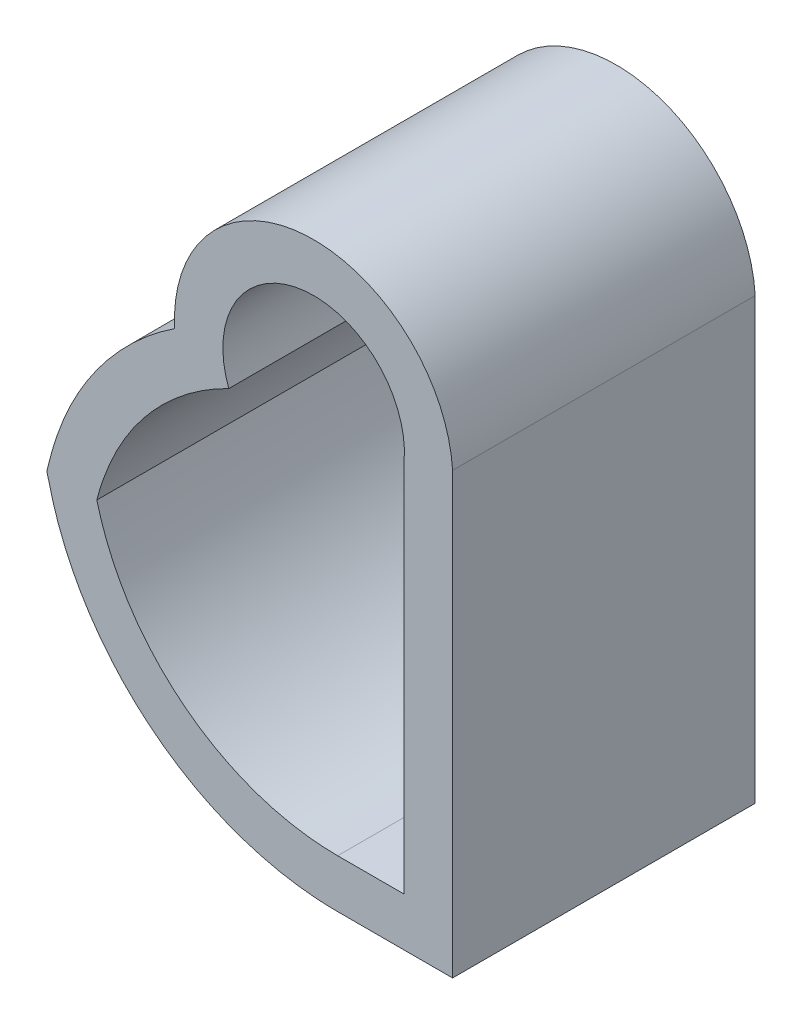
ISO-10303-21;
HEADER;
FILE_DESCRIPTION(('STEP AP214'),'2;1');
FILE_NAME('part.step','',(''),(''),'','','');
FILE_SCHEMA(('AUTOMOTIVE_DESIGN { 1 0 10303 214 1 1 1 1 }'));
ENDSEC;
DATA;
#1=APPLICATION_CONTEXT('core data for automotive mechanical design processes');
#2=APPLICATION_PROTOCOL_DEFINITION('international standard','automotive_design',2000,#1);
#3=PRODUCT_CONTEXT('',#1,'mechanical');
#4=PRODUCT('Part','Part','',(#3));
#5=PRODUCT_RELATED_PRODUCT_CATEGORY('part','',(#4));
#6=PRODUCT_DEFINITION_FORMATION('','',#4);
#7=PRODUCT_DEFINITION_CONTEXT('part definition',#1,'design');
#8=PRODUCT_DEFINITION('design','',#6,#7);
#9=PRODUCT_DEFINITION_SHAPE('','',#8);
#10=(LENGTH_UNIT() NAMED_UNIT(*) SI_UNIT(.MILLI.,.METRE.));
#11=(NAMED_UNIT(*) PLANE_ANGLE_UNIT() SI_UNIT($,.RADIAN.));
#12=(NAMED_UNIT(*) SI_UNIT($,.STERADIAN.) SOLID_ANGLE_UNIT());
#13=UNCERTAINTY_MEASURE_WITH_UNIT(LENGTH_MEASURE(1.E-05),#10,'distance_accuracy_value','');
#14=(GEOMETRIC_REPRESENTATION_CONTEXT(3) GLOBAL_UNCERTAINTY_ASSIGNED_CONTEXT((#13)) GLOBAL_UNIT_ASSIGNED_CONTEXT((#10,
#11,#12)) REPRESENTATION_CONTEXT('',''));
#15=CARTESIAN_POINT('',(0.,0.,0.));
#16=DIRECTION('',(0.,0.,1.));
#17=DIRECTION('',(1.,0.,0.));
#18=AXIS2_PLACEMENT_3D('',#15,#16,#17);
#19=CARTESIAN_POINT('',(-76.2046167711567,20.1,5.));
#20=CARTESIAN_POINT('',(-76.597790928582,20.1,5.));
#21=CARTESIAN_POINT('',(-77.1082767883717,20.0255515807739,5.));
#22=CARTESIAN_POINT('',(-77.802572759434,19.7881634255075,5.));
#23=CARTESIAN_POINT('',(-78.2614563406859,19.5644868104972,5.));
#24=CARTESIAN_POINT('',(-78.9676564377848,19.0821697685239,5.));
#25=CARTESIAN_POINT('',(-79.7078845361215,18.2793170860178,5.));
#26=CARTESIAN_POINT('',(-80.0714632749386,17.4357149346957,5.));
#27=CARTESIAN_POINT('',(-80.1840539856276,17.,5.));
#28=B_SPLINE_CURVE_WITH_KNOTS('',3,(#19,#20,#21,#22,#23,#24,#25,#26,#27),.UNSPECIFIED.,.F.,.F.,
(4,1,1,1,1,1,4),(0.,0.218460434529764,0.281267317658654,0.406881083916433,0.502455065031119,
0.753682597546679,1.00491013006224),.UNSPECIFIED.);
#29=DIRECTION('',(0.,0.,-1.));
#30=VECTOR('',#29,1.);
#31=SURFACE_OF_LINEAR_EXTRUSION('',#28,#30);
#32=CARTESIAN_POINT('',(-76.2046167711567,20.1,0.));
#33=CARTESIAN_POINT('',(-76.597790928582,20.1,0.));
#34=CARTESIAN_POINT('',(-77.1082767883717,20.0255515807739,0.));
#35=CARTESIAN_POINT('',(-77.802572759434,19.7881634255075,0.));
#36=CARTESIAN_POINT('',(-78.2614563406859,19.5644868104972,0.));
#37=CARTESIAN_POINT('',(-78.9676564377848,19.0821697685239,0.));
#38=CARTESIAN_POINT('',(-79.7078845361215,18.2793170860178,0.));
#39=CARTESIAN_POINT('',(-80.0714632749386,17.4357149346957,0.));
#40=CARTESIAN_POINT('',(-80.1840539856276,17.,0.));
#41=B_SPLINE_CURVE_WITH_KNOTS('',3,(#32,#33,#34,#35,#36,#37,#38,#39,#40),.UNSPECIFIED.,.F.,.F.,
(4,1,1,1,1,1,4),(0.,0.218460434529764,0.281267317658654,0.406881083916433,0.502455065031119,
0.753682597546679,1.00491013006224),.UNSPECIFIED.);
#42=CARTESIAN_POINT('',(-78.0035151838176,19.6850108622537,0.));
#43=VERTEX_POINT('',#42);
#44=CARTESIAN_POINT('',(-80.1840539856276,17.,0.));
#45=VERTEX_POINT('',#44);
#46=EDGE_CURVE('E251',#43,#45,#41,.T.);
#47=ORIENTED_EDGE('',*,*,#46,.F.);
#48=DIRECTION('',(0.,0.,-1.));
#49=VECTOR('',#48,1.);
#50=CARTESIAN_POINT('',(-78.0035151838176,19.6850108622537,5.));
#51=LINE('',#50,#49);
#52=CARTESIAN_POINT('',(-78.0035151838176,19.6850108622537,5.));
#53=VERTEX_POINT('',#52);
#54=EDGE_CURVE('E11',#53,#43,#51,.T.);
#55=ORIENTED_EDGE('',*,*,#54,.F.);
#56=CARTESIAN_POINT('',(-80.1840539856276,17.,5.));
#57=VERTEX_POINT('',#56);
#58=EDGE_CURVE('E192',#53,#57,#28,.T.);
#59=ORIENTED_EDGE('',*,*,#58,.T.);
#60=DIRECTION('',(0.,0.,-1.));
#61=VECTOR('',#60,1.);
#62=CARTESIAN_POINT('',(-80.1840539856276,17.,5.));
#63=LINE('',#62,#61);
#64=EDGE_CURVE('E67',#57,#45,#63,.T.);
#65=ORIENTED_EDGE('',*,*,#64,.T.);
#66=EDGE_LOOP('',(#47,#55,#59,#65));
#67=FACE_BOUND('',#66,.T.);
#68=ADVANCED_FACE('F47',(#67),#31,.T.);
#69=CARTESIAN_POINT('',(-76.6013458755459,20.2178534571549,5.));
#70=DIRECTION('',(0.,0.,-1.));
#71=DIRECTION('',(-1.,0.,0.));
#72=AXIS2_PLACEMENT_3D('',#69,#70,#71);
#73=CYLINDRICAL_SURFACE('',#72,1.50000000000001);
#74=CARTESIAN_POINT('',(-76.6013458755459,20.2178534571549,0.));
#75=DIRECTION('',(0.,0.,1.));
#76=DIRECTION('',(1.,0.,0.));
#77=AXIS2_PLACEMENT_3D('',#74,#75,#76);
#78=CIRCLE('',#77,1.50000000000001);
#79=CARTESIAN_POINT('',(-75.1059828551938,20.1,0.));
#80=VERTEX_POINT('',#79);
#81=EDGE_CURVE('E206',#80,#43,#78,.T.);
#82=ORIENTED_EDGE('',*,*,#81,.F.);
#83=DIRECTION('',(0.,0.,-1.));
#84=VECTOR('',#83,1.);
#85=CARTESIAN_POINT('',(-75.1059828551938,20.1,5.));
#86=LINE('',#85,#84);
#87=CARTESIAN_POINT('',(-75.1059828551938,20.1,5.));
#88=VERTEX_POINT('',#87);
#89=EDGE_CURVE('E58',#88,#80,#86,.T.);
#90=ORIENTED_EDGE('',*,*,#89,.F.);
#91=CARTESIAN_POINT('',(-76.6013458755459,20.2178534571549,5.));
#92=DIRECTION('',(0.,0.,1.));
#93=DIRECTION('',(1.,0.,0.));
#94=AXIS2_PLACEMENT_3D('',#91,#92,#93);
#95=CIRCLE('',#94,1.50000000000001);
#96=EDGE_CURVE('E152',#88,#53,#95,.T.);
#97=ORIENTED_EDGE('',*,*,#96,.T.);
#98=ORIENTED_EDGE('',*,*,#54,.T.);
#99=EDGE_LOOP('',(#82,#90,#97,#98));
#100=FACE_BOUND('',#99,.T.);
#101=ADVANCED_FACE('F184',(#100),#73,.F.);
#102=CARTESIAN_POINT('',(-75.1059828551938,0.,5.));
#103=DIRECTION('',(-1.,0.,0.));
#104=DIRECTION('',(0.,0.,1.));
#105=AXIS2_PLACEMENT_3D('',#102,#103,#104);
#106=PLANE('',#105);
#107=DIRECTION('',(0.,1.,0.));
#108=VECTOR('',#107,1.);
#109=CARTESIAN_POINT('',(-75.1059828551938,0.,0.));
#110=LINE('',#109,#108);
#111=CARTESIAN_POINT('',(-75.1059828551938,13.9,0.));
#112=VERTEX_POINT('',#111);
#113=EDGE_CURVE('E138',#112,#80,#110,.T.);
#114=ORIENTED_EDGE('',*,*,#113,.F.);
#115=DIRECTION('',(0.,0.,-1.));
#116=VECTOR('',#115,1.);
#117=CARTESIAN_POINT('',(-75.1059828551938,13.9,5.));
#118=LINE('',#117,#116);
#119=CARTESIAN_POINT('',(-75.1059828551938,13.9,5.));
#120=VERTEX_POINT('',#119);
#121=EDGE_CURVE('E133',#120,#112,#118,.T.);
#122=ORIENTED_EDGE('',*,*,#121,.F.);
#123=DIRECTION('',(0.,1.,0.));
#124=VECTOR('',#123,1.);
#125=CARTESIAN_POINT('',(-75.1059828551938,0.,5.));
#126=LINE('',#125,#124);
#127=EDGE_CURVE('E136',#120,#88,#126,.T.);
#128=ORIENTED_EDGE('',*,*,#127,.T.);
#129=ORIENTED_EDGE('',*,*,#89,.T.);
#130=EDGE_LOOP('',(#114,#122,#128,#129));
#131=FACE_BOUND('',#130,.T.);
#132=ADVANCED_FACE('F135',(#131),#106,.T.);
#133=CARTESIAN_POINT('',(0.,13.9,5.));
#134=DIRECTION('',(0.,1.,0.));
#135=DIRECTION('',(0.,0.,1.));
#136=AXIS2_PLACEMENT_3D('',#133,#134,#135);
#137=PLANE('',#136);
#138=DIRECTION('',(1.,0.,0.));
#139=VECTOR('',#138,1.);
#140=CARTESIAN_POINT('',(0.,13.9,0.));
#141=LINE('',#140,#139);
#142=CARTESIAN_POINT('',(-76.2046167711572,13.9,0.));
#143=VERTEX_POINT('',#142);
#144=EDGE_CURVE('E241',#143,#112,#141,.T.);
#145=ORIENTED_EDGE('',*,*,#144,.F.);
#146=DIRECTION('',(0.,0.,-1.));
#147=VECTOR('',#146,1.);
#148=CARTESIAN_POINT('',(-76.2046167711572,13.9,5.));
#149=LINE('',#148,#147);
#150=CARTESIAN_POINT('',(-76.2046167711572,13.9,5.));
#151=VERTEX_POINT('',#150);
#152=EDGE_CURVE('E98',#151,#143,#149,.T.);
#153=ORIENTED_EDGE('',*,*,#152,.F.);
#154=DIRECTION('',(1.,0.,0.));
#155=VECTOR('',#154,1.);
#156=CARTESIAN_POINT('',(0.,13.9,5.));
#157=LINE('',#156,#155);
#158=EDGE_CURVE('E150',#151,#120,#157,.T.);
#159=ORIENTED_EDGE('',*,*,#158,.T.);
#160=ORIENTED_EDGE('',*,*,#121,.T.);
#161=EDGE_LOOP('',(#145,#153,#159,#160));
#162=FACE_BOUND('',#161,.T.);
#163=ADVANCED_FACE('F155',(#162),#137,.T.);
#164=CARTESIAN_POINT('',(-76.6013458755459,20.2178534571549,5.));
#165=DIRECTION('',(0.,0.,-1.));
#166=DIRECTION('',(-1.,0.,0.));
#167=AXIS2_PLACEMENT_3D('',#164,#165,#166);
#168=CYLINDRICAL_SURFACE('',#167,2.3);
#169=CARTESIAN_POINT('',(-76.6013458755459,20.2178534571549,0.));
#170=DIRECTION('',(0.,0.,1.));
#171=DIRECTION('',(1.,0.,0.));
#172=AXIS2_PLACEMENT_3D('',#169,#170,#171);
#173=CIRCLE('',#172,2.3);
#174=CARTESIAN_POINT('',(-74.3059828551938,20.3638281289306,0.));
#175=VERTEX_POINT('',#174);
#176=CARTESIAN_POINT('',(-78.8980615615279,20.0949833722514,0.));
#177=VERTEX_POINT('',#176);
#178=EDGE_CURVE('E167',#175,#177,#173,.T.);
#179=ORIENTED_EDGE('',*,*,#178,.T.);
#180=DIRECTION('',(0.,0.,-1.));
#181=VECTOR('',#180,1.);
#182=CARTESIAN_POINT('',(-78.8980615615279,20.0949833722514,5.));
#183=LINE('',#182,#181);
#184=CARTESIAN_POINT('',(-78.8980615615279,20.0949833722514,5.));
#185=VERTEX_POINT('',#184);
#186=EDGE_CURVE('E51',#185,#177,#183,.T.);
#187=ORIENTED_EDGE('',*,*,#186,.F.);
#188=CARTESIAN_POINT('',(-76.6013458755459,20.2178534571549,5.));
#189=DIRECTION('',(0.,0.,1.));
#190=DIRECTION('',(1.,0.,0.));
#191=AXIS2_PLACEMENT_3D('',#188,#189,#190);
#192=CIRCLE('',#191,2.3);
#193=CARTESIAN_POINT('',(-74.3059828551938,20.3638281289306,5.));
#194=VERTEX_POINT('',#193);
#195=EDGE_CURVE('E240',#194,#185,#192,.T.);
#196=ORIENTED_EDGE('',*,*,#195,.F.);
#197=DIRECTION('',(0.,0.,-1.));
#198=VECTOR('',#197,1.);
#199=CARTESIAN_POINT('',(-74.3059828551938,20.3638281289306,5.));
#200=LINE('',#199,#198);
#201=EDGE_CURVE('E160',#194,#175,#200,.T.);
#202=ORIENTED_EDGE('',*,*,#201,.T.);
#203=EDGE_LOOP('',(#179,#187,#196,#202));
#204=FACE_BOUND('',#203,.T.);
#205=ADVANCED_FACE('F49',(#204),#168,.T.);
#206=CARTESIAN_POINT('',(-76.2046167711567,20.9,5.));
#207=CARTESIAN_POINT('',(-76.7655828097108,20.9,5.));
#208=CARTESIAN_POINT('',(-77.8989921598437,20.702287279111,5.));
#209=CARTESIAN_POINT('',(-79.3806469830471,19.8603276159395,5.));
#210=CARTESIAN_POINT('',(-80.3130861883544,18.7755258940519,5.));
#211=CARTESIAN_POINT('',(-80.7409118477536,17.8968578304314,5.));
#212=CARTESIAN_POINT('',(-80.9010912341441,17.4214012422871,5.));
#213=CARTESIAN_POINT('',(-80.969166273565,17.1595752717701,5.));
#214=CARTESIAN_POINT('',(-80.9960103547809,17.0554217091426,5.));
#215=CARTESIAN_POINT('',(-81.0103315752006,17.,5.));
#216=B_SPLINE_CURVE_WITH_KNOTS('',3,(#206,#207,#208,#209,#210,#211,#212,#213,#214,#215),
.UNSPECIFIED.,.F.,.F.,(4,1,1,1,1,1,1,4),(0.,0.261047792639971,0.522095585279941,
0.783143377919912,0.913667274239897,0.978929222399889,1.01156019647989,1.04419117055988),.UNSPECIFIED.);
#217=DIRECTION('',(0.,0.,-1.));
#218=VECTOR('',#217,1.);
#219=SURFACE_OF_LINEAR_EXTRUSION('',#216,#218);
#220=CARTESIAN_POINT('',(-76.2046167711567,20.9,0.));
#221=CARTESIAN_POINT('',(-76.7655828097108,20.9,0.));
#222=CARTESIAN_POINT('',(-77.8989921598437,20.702287279111,0.));
#223=CARTESIAN_POINT('',(-79.3806469830471,19.8603276159395,0.));
#224=CARTESIAN_POINT('',(-80.3130861883544,18.7755258940519,0.));
#225=CARTESIAN_POINT('',(-80.7409118477536,17.8968578304314,0.));
#226=CARTESIAN_POINT('',(-80.9010912341441,17.4214012422871,0.));
#227=CARTESIAN_POINT('',(-80.969166273565,17.1595752717701,0.));
#228=CARTESIAN_POINT('',(-80.9960103547809,17.0554217091426,0.));
#229=CARTESIAN_POINT('',(-81.0103315752006,17.,0.));
#230=B_SPLINE_CURVE_WITH_KNOTS('',3,(#220,#221,#222,#223,#224,#225,#226,#227,#228,#229),
.UNSPECIFIED.,.F.,.F.,(4,1,1,1,1,1,1,4),(0.,0.261047792639971,0.522095585279941,
0.783143377919912,0.913667274239897,0.978929222399889,1.01156019647989,1.04419117055988),.UNSPECIFIED.);
#231=CARTESIAN_POINT('',(-81.0103315752006,17.,0.));
#232=VERTEX_POINT('',#231);
#233=EDGE_CURVE('E269',#177,#232,#230,.T.);
#234=ORIENTED_EDGE('',*,*,#233,.T.);
#235=DIRECTION('',(0.,0.,-1.));
#236=VECTOR('',#235,1.);
#237=CARTESIAN_POINT('',(-81.0103315752006,17.,5.));
#238=LINE('',#237,#236);
#239=CARTESIAN_POINT('',(-81.0103315752006,17.,5.));
#240=VERTEX_POINT('',#239);
#241=EDGE_CURVE('E221',#240,#232,#238,.T.);
#242=ORIENTED_EDGE('',*,*,#241,.F.);
#243=EDGE_CURVE('E111',#185,#240,#216,.T.);
#244=ORIENTED_EDGE('',*,*,#243,.F.);
#245=ORIENTED_EDGE('',*,*,#186,.T.);
#246=EDGE_LOOP('',(#234,#242,#244,#245));
#247=FACE_BOUND('',#246,.T.);
#248=ADVANCED_FACE('F315',(#247),#219,.F.);
#249=CARTESIAN_POINT('',(-81.0103315752006,17.,5.));
#250=CARTESIAN_POINT('',(-80.9959122144421,16.9441984974355,5.));
#251=CARTESIAN_POINT('',(-80.9688813676613,16.8392706038394,5.));
#252=CARTESIAN_POINT('',(-80.9003566762098,16.5760139243834,5.));
#253=CARTESIAN_POINT('',(-80.7416717138106,16.1051703668809,5.));
#254=CARTESIAN_POINT('',(-80.3116958129159,15.2215719557837,5.));
#255=CARTESIAN_POINT('',(-79.3787147397677,14.1377224477854,5.));
#256=CARTESIAN_POINT('',(-77.8919142823846,13.2952624999842,5.));
#257=CARTESIAN_POINT('',(-76.7638812907922,13.1,5.));
#258=CARTESIAN_POINT('',(-76.2046167711572,13.1,5.));
#259=B_SPLINE_CURVE_WITH_KNOTS('',3,(#249,#250,#251,#252,#253,#254,#255,#256,#257,#258),
.UNSPECIFIED.,.F.,.F.,(4,1,1,1,1,1,1,4),(-0.0438772017812973,-0.0112560392256317,
0.0213651233300338,0.0866074484413649,0.217092098664027,0.478061399109351,0.739030699554676,1.),.UNSPECIFIED.);
#260=DIRECTION('',(0.,0.,-1.));
#261=VECTOR('',#260,1.);
#262=SURFACE_OF_LINEAR_EXTRUSION('',#259,#261);
#263=CARTESIAN_POINT('',(-81.0103315752006,17.,0.));
#264=CARTESIAN_POINT('',(-80.9959122144421,16.9441984974355,0.));
#265=CARTESIAN_POINT('',(-80.9688813676613,16.8392706038394,0.));
#266=CARTESIAN_POINT('',(-80.9003566762098,16.5760139243834,0.));
#267=CARTESIAN_POINT('',(-80.7416717138106,16.1051703668809,0.));
#268=CARTESIAN_POINT('',(-80.3116958129159,15.2215719557837,0.));
#269=CARTESIAN_POINT('',(-79.3787147397677,14.1377224477854,0.));
#270=CARTESIAN_POINT('',(-77.8919142823846,13.2952624999842,0.));
#271=CARTESIAN_POINT('',(-76.7638812907922,13.1,0.));
#272=CARTESIAN_POINT('',(-76.2046167711572,13.1,0.));
#273=B_SPLINE_CURVE_WITH_KNOTS('',3,(#263,#264,#265,#266,#267,#268,#269,#270,#271,#272),
.UNSPECIFIED.,.F.,.F.,(4,1,1,1,1,1,1,4),(-0.0438772017812973,-0.0112560392256317,
0.0213651233300338,0.0866074484413649,0.217092098664027,0.478061399109351,0.739030699554676,1.),.UNSPECIFIED.);
#274=CARTESIAN_POINT('',(-76.2046167711572,13.1,0.));
#275=VERTEX_POINT('',#274);
#276=EDGE_CURVE('E265',#232,#275,#273,.T.);
#277=ORIENTED_EDGE('',*,*,#276,.T.);
#278=DIRECTION('',(0.,0.,-1.));
#279=VECTOR('',#278,1.);
#280=CARTESIAN_POINT('',(-76.2046167711572,13.1,5.));
#281=LINE('',#280,#279);
#282=CARTESIAN_POINT('',(-76.2046167711572,13.1,5.));
#283=VERTEX_POINT('',#282);
#284=EDGE_CURVE('E218',#283,#275,#281,.T.);
#285=ORIENTED_EDGE('',*,*,#284,.F.);
#286=EDGE_CURVE('E298',#240,#283,#259,.T.);
#287=ORIENTED_EDGE('',*,*,#286,.F.);
#288=ORIENTED_EDGE('',*,*,#241,.T.);
#289=EDGE_LOOP('',(#277,#285,#287,#288));
#290=FACE_BOUND('',#289,.T.);
#291=ADVANCED_FACE('F289',(#290),#262,.F.);
#292=CARTESIAN_POINT('',(0.,13.1,5.));
#293=DIRECTION('',(0.,1.,0.));
#294=DIRECTION('',(0.,0.,1.));
#295=AXIS2_PLACEMENT_3D('',#292,#293,#294);
#296=PLANE('',#295);
#297=DIRECTION('',(1.,0.,0.));
#298=VECTOR('',#297,1.);
#299=CARTESIAN_POINT('',(0.,13.1,0.));
#300=LINE('',#299,#298);
#301=CARTESIAN_POINT('',(-74.3059828551938,13.1,0.));
#302=VERTEX_POINT('',#301);
#303=EDGE_CURVE('E262',#275,#302,#300,.T.);
#304=ORIENTED_EDGE('',*,*,#303,.T.);
#305=DIRECTION('',(0.,0.,-1.));
#306=VECTOR('',#305,1.);
#307=CARTESIAN_POINT('',(-74.3059828551938,13.1,5.));
#308=LINE('',#307,#306);
#309=CARTESIAN_POINT('',(-74.3059828551938,13.1,5.));
#310=VERTEX_POINT('',#309);
#311=EDGE_CURVE('E214',#310,#302,#308,.T.);
#312=ORIENTED_EDGE('',*,*,#311,.F.);
#313=DIRECTION('',(1.,0.,0.));
#314=VECTOR('',#313,1.);
#315=CARTESIAN_POINT('',(0.,13.1,5.));
#316=LINE('',#315,#314);
#317=EDGE_CURVE('E294',#283,#310,#316,.T.);
#318=ORIENTED_EDGE('',*,*,#317,.F.);
#319=ORIENTED_EDGE('',*,*,#284,.T.);
#320=EDGE_LOOP('',(#304,#312,#318,#319));
#321=FACE_BOUND('',#320,.T.);
#322=ADVANCED_FACE('F292',(#321),#296,.F.);
#323=CARTESIAN_POINT('',(-74.3059828551938,0.,5.));
#324=DIRECTION('',(-1.,0.,0.));
#325=DIRECTION('',(0.,0.,1.));
#326=AXIS2_PLACEMENT_3D('',#323,#324,#325);
#327=PLANE('',#326);
#328=DIRECTION('',(0.,1.,0.));
#329=VECTOR('',#328,1.);
#330=CARTESIAN_POINT('',(-74.3059828551938,0.,0.));
#331=LINE('',#330,#329);
#332=EDGE_CURVE('E256',#302,#175,#331,.T.);
#333=ORIENTED_EDGE('',*,*,#332,.T.);
#334=ORIENTED_EDGE('',*,*,#201,.F.);
#335=DIRECTION('',(0.,1.,0.));
#336=VECTOR('',#335,1.);
#337=CARTESIAN_POINT('',(-74.3059828551938,0.,5.));
#338=LINE('',#337,#336);
#339=EDGE_CURVE('E198',#310,#194,#338,.T.);
#340=ORIENTED_EDGE('',*,*,#339,.F.);
#341=ORIENTED_EDGE('',*,*,#311,.T.);
#342=EDGE_LOOP('',(#333,#334,#340,#341));
#343=FACE_BOUND('',#342,.T.);
#344=ADVANCED_FACE('F177',(#343),#327,.F.);
#345=CARTESIAN_POINT('',(-80.1840539856276,17.,5.));
#346=CARTESIAN_POINT('',(-80.0713386541117,16.5638027950072,5.));
#347=CARTESIAN_POINT('',(-79.7070402783934,15.719265763601,5.));
#348=CARTESIAN_POINT('',(-78.7731661667866,14.7069354308034,5.));
#349=CARTESIAN_POINT('',(-77.5638002227216,14.0510220808235,5.));
#350=CARTESIAN_POINT('',(-76.6553062583656,13.9,5.));
#351=CARTESIAN_POINT('',(-76.2046167711572,13.9,5.));
#352=B_SPLINE_CURVE_WITH_KNOTS('',3,(#345,#346,#347,#348,#349,#350,#351),.UNSPECIFIED.,.F.,.F.,
(4,1,1,1,4),(-0.00487524464234236,0.246343566518243,0.497562377678829,0.748781188839414,1.),.UNSPECIFIED.);
#353=DIRECTION('',(0.,0.,-1.));
#354=VECTOR('',#353,1.);
#355=SURFACE_OF_LINEAR_EXTRUSION('',#352,#354);
#356=CARTESIAN_POINT('',(-80.1840539856276,17.,0.));
#357=CARTESIAN_POINT('',(-80.0713386541117,16.5638027950072,0.));
#358=CARTESIAN_POINT('',(-79.7070402783934,15.719265763601,0.));
#359=CARTESIAN_POINT('',(-78.7731661667866,14.7069354308034,0.));
#360=CARTESIAN_POINT('',(-77.5638002227216,14.0510220808235,0.));
#361=CARTESIAN_POINT('',(-76.6553062583656,13.9,0.));
#362=CARTESIAN_POINT('',(-76.2046167711572,13.9,0.));
#363=B_SPLINE_CURVE_WITH_KNOTS('',3,(#356,#357,#358,#359,#360,#361,#362),.UNSPECIFIED.,.F.,.F.,
(4,1,1,1,4),(-0.00487524464234236,0.246343566518243,0.497562377678829,0.748781188839414,1.),.UNSPECIFIED.);
#364=EDGE_CURVE('E234',#45,#143,#363,.T.);
#365=ORIENTED_EDGE('',*,*,#364,.F.);
#366=ORIENTED_EDGE('',*,*,#64,.F.);
#367=EDGE_CURVE('E157',#57,#151,#352,.T.);
#368=ORIENTED_EDGE('',*,*,#367,.T.);
#369=ORIENTED_EDGE('',*,*,#152,.T.);
#370=EDGE_LOOP('',(#365,#366,#368,#369));
#371=FACE_BOUND('',#370,.T.);
#372=ADVANCED_FACE('F173',(#371),#355,.T.);
#373=CARTESIAN_POINT('',(0.,0.,5.));
#374=DIRECTION('',(0.,0.,1.));
#375=DIRECTION('',(1.,0.,0.));
#376=AXIS2_PLACEMENT_3D('',#373,#374,#375);
#377=PLANE('',#376);
#378=ORIENTED_EDGE('',*,*,#195,.T.);
#379=ORIENTED_EDGE('',*,*,#243,.T.);
#380=ORIENTED_EDGE('',*,*,#286,.T.);
#381=ORIENTED_EDGE('',*,*,#317,.T.);
#382=ORIENTED_EDGE('',*,*,#339,.T.);
#383=EDGE_LOOP('',(#378,#379,#380,#381,#382));
#384=FACE_BOUND('',#383,.T.);
#385=ORIENTED_EDGE('',*,*,#58,.F.);
#386=ORIENTED_EDGE('',*,*,#96,.F.);
#387=ORIENTED_EDGE('',*,*,#127,.F.);
#388=ORIENTED_EDGE('',*,*,#158,.F.);
#389=ORIENTED_EDGE('',*,*,#367,.F.);
#390=EDGE_LOOP('',(#385,#386,#387,#388,#389));
#391=FACE_BOUND('',#390,.T.);
#392=ADVANCED_FACE('F148',(#384,#391),#377,.T.);
#393=CARTESIAN_POINT('',(0.,0.,0.));
#394=DIRECTION('',(0.,0.,1.));
#395=DIRECTION('',(1.,0.,0.));
#396=AXIS2_PLACEMENT_3D('',#393,#394,#395);
#397=PLANE('',#396);
#398=ORIENTED_EDGE('',*,*,#178,.F.);
#399=ORIENTED_EDGE('',*,*,#332,.F.);
#400=ORIENTED_EDGE('',*,*,#303,.F.);
#401=ORIENTED_EDGE('',*,*,#276,.F.);
#402=ORIENTED_EDGE('',*,*,#233,.F.);
#403=EDGE_LOOP('',(#398,#399,#400,#401,#402));
#404=FACE_BOUND('',#403,.T.);
#405=ORIENTED_EDGE('',*,*,#46,.T.);
#406=ORIENTED_EDGE('',*,*,#364,.T.);
#407=ORIENTED_EDGE('',*,*,#144,.T.);
#408=ORIENTED_EDGE('',*,*,#113,.T.);
#409=ORIENTED_EDGE('',*,*,#81,.T.);
#410=EDGE_LOOP('',(#405,#406,#407,#408,#409));
#411=FACE_BOUND('',#410,.T.);
#412=ADVANCED_FACE('F178',(#404,#411),#397,.F.);
#413=CLOSED_SHELL('',(#68,#101,#132,#163,#205,#248,#291,#322,#344,#372,#392,#412));
#414=MANIFOLD_SOLID_BREP('B2',#413);
#415=ADVANCED_BREP_SHAPE_REPRESENTATION('',(#18,#414),#14);
#416=SHAPE_DEFINITION_REPRESENTATION(#9,#415);
ENDSEC;
END-ISO-10303-21;
